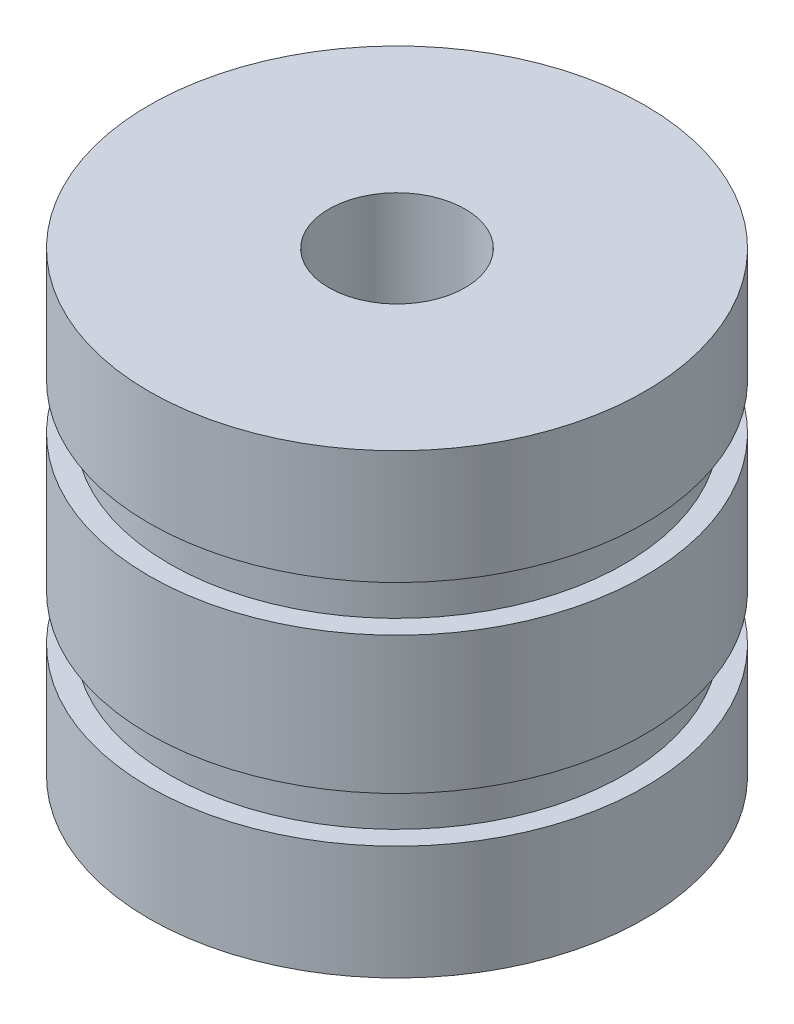
ISO-10303-21;
HEADER;
FILE_DESCRIPTION(('STEP AP214'),'2;1');
FILE_NAME('part.step','',(''),(''),'','','');
FILE_SCHEMA(('AUTOMOTIVE_DESIGN { 1 0 10303 214 1 1 1 1 }'));
ENDSEC;
DATA;
#1=APPLICATION_CONTEXT('core data for automotive mechanical design processes');
#2=APPLICATION_PROTOCOL_DEFINITION('international standard','automotive_design',2000,#1);
#3=PRODUCT_CONTEXT('',#1,'mechanical');
#4=PRODUCT('Part','Part','',(#3));
#5=PRODUCT_RELATED_PRODUCT_CATEGORY('part','',(#4));
#6=PRODUCT_DEFINITION_FORMATION('','',#4);
#7=PRODUCT_DEFINITION_CONTEXT('part definition',#1,'design');
#8=PRODUCT_DEFINITION('design','',#6,#7);
#9=PRODUCT_DEFINITION_SHAPE('','',#8);
#10=(LENGTH_UNIT() NAMED_UNIT(*) SI_UNIT(.MILLI.,.METRE.));
#11=(NAMED_UNIT(*) PLANE_ANGLE_UNIT() SI_UNIT($,.RADIAN.));
#12=(NAMED_UNIT(*) SI_UNIT($,.STERADIAN.) SOLID_ANGLE_UNIT());
#13=UNCERTAINTY_MEASURE_WITH_UNIT(LENGTH_MEASURE(1.E-05),#10,'distance_accuracy_value','');
#14=(GEOMETRIC_REPRESENTATION_CONTEXT(3) GLOBAL_UNCERTAINTY_ASSIGNED_CONTEXT((#13)) GLOBAL_UNIT_ASSIGNED_CONTEXT((#10,
#11,#12)) REPRESENTATION_CONTEXT('',''));
#15=CARTESIAN_POINT('',(0.,0.,0.));
#16=DIRECTION('',(0.,0.,1.));
#17=DIRECTION('',(1.,0.,0.));
#18=AXIS2_PLACEMENT_3D('',#15,#16,#17);
#19=CARTESIAN_POINT('',(0.,0.,0.));
#20=DIRECTION('',(0.,1.,0.));
#21=DIRECTION('',(0.,0.,1.));
#22=AXIS2_PLACEMENT_3D('',#19,#20,#21);
#23=PLANE('',#22);
#24=CARTESIAN_POINT('',(0.,0.,0.));
#25=DIRECTION('',(0.,1.,0.));
#26=DIRECTION('',(0.,0.,1.));
#27=AXIS2_PLACEMENT_3D('',#24,#25,#26);
#28=CIRCLE('',#27,6.);
#29=CARTESIAN_POINT('',(0.,0.,6.));
#30=VERTEX_POINT('',#29);
#31=EDGE_CURVE('E11',#30,#30,#28,.T.);
#32=ORIENTED_EDGE('',*,*,#31,.F.);
#33=EDGE_LOOP('',(#32));
#34=FACE_BOUND('',#33,.T.);
#35=ADVANCED_FACE('F44',(#34),#23,.F.);
#36=CARTESIAN_POINT('',(0.,48.8279050139115,0.));
#37=DIRECTION('',(0.,1.,0.));
#38=DIRECTION('',(0.,0.,1.));
#39=AXIS2_PLACEMENT_3D('',#36,#37,#38);
#40=CYLINDRICAL_SURFACE('',#39,6.);
#41=CARTESIAN_POINT('',(0.,2.76262293916898,0.));
#42=DIRECTION('',(0.,1.,0.));
#43=DIRECTION('',(0.,0.,1.));
#44=AXIS2_PLACEMENT_3D('',#41,#42,#43);
#45=CIRCLE('',#44,6.);
#46=CARTESIAN_POINT('',(0.,2.76262293916898,6.));
#47=VERTEX_POINT('',#46);
#48=EDGE_CURVE('E51',#47,#47,#45,.T.);
#49=ORIENTED_EDGE('',*,*,#48,.F.);
#50=EDGE_LOOP('',(#49));
#51=FACE_BOUND('',#50,.T.);
#52=ORIENTED_EDGE('',*,*,#31,.T.);
#53=EDGE_LOOP('',(#52));
#54=FACE_BOUND('',#53,.T.);
#55=ADVANCED_FACE('F108',(#51,#54),#40,.T.);
#56=CARTESIAN_POINT('',(6.,2.76262293916898,0.));
#57=DIRECTION('',(0.,-1.,0.));
#58=DIRECTION('',(0.,0.,-1.));
#59=AXIS2_PLACEMENT_3D('',#56,#57,#58);
#60=PLANE('',#59);
#61=CARTESIAN_POINT('',(0.,2.76262293916898,0.));
#62=DIRECTION('',(0.,1.,0.));
#63=DIRECTION('',(0.,0.,1.));
#64=AXIS2_PLACEMENT_3D('',#61,#62,#63);
#65=CIRCLE('',#64,5.5);
#66=CARTESIAN_POINT('',(0.,2.76262293916898,5.5));
#67=VERTEX_POINT('',#66);
#68=EDGE_CURVE('E99',#67,#67,#65,.T.);
#69=ORIENTED_EDGE('',*,*,#68,.F.);
#70=EDGE_LOOP('',(#69));
#71=FACE_BOUND('',#70,.T.);
#72=ORIENTED_EDGE('',*,*,#48,.T.);
#73=EDGE_LOOP('',(#72));
#74=FACE_BOUND('',#73,.T.);
#75=ADVANCED_FACE('F106',(#71,#74),#60,.F.);
#76=CARTESIAN_POINT('',(0.,48.8279050139115,0.));
#77=DIRECTION('',(0.,1.,0.));
#78=DIRECTION('',(0.,0.,1.));
#79=AXIS2_PLACEMENT_3D('',#76,#77,#78);
#80=CYLINDRICAL_SURFACE('',#79,5.5);
#81=CARTESIAN_POINT('',(0.,3.86767211483657,0.));
#82=DIRECTION('',(0.,1.,0.));
#83=DIRECTION('',(0.,0.,1.));
#84=AXIS2_PLACEMENT_3D('',#81,#82,#83);
#85=CIRCLE('',#84,5.5);
#86=CARTESIAN_POINT('',(0.,3.86767211483657,5.5));
#87=VERTEX_POINT('',#86);
#88=EDGE_CURVE('E95',#87,#87,#85,.T.);
#89=ORIENTED_EDGE('',*,*,#88,.F.);
#90=EDGE_LOOP('',(#89));
#91=FACE_BOUND('',#90,.T.);
#92=ORIENTED_EDGE('',*,*,#68,.T.);
#93=EDGE_LOOP('',(#92));
#94=FACE_BOUND('',#93,.T.);
#95=ADVANCED_FACE('F126',(#91,#94),#80,.T.);
#96=CARTESIAN_POINT('',(5.5,3.86767211483657,0.));
#97=DIRECTION('',(0.,1.,0.));
#98=DIRECTION('',(0.,0.,1.));
#99=AXIS2_PLACEMENT_3D('',#96,#97,#98);
#100=PLANE('',#99);
#101=CARTESIAN_POINT('',(0.,3.86767211483657,0.));
#102=DIRECTION('',(0.,1.,0.));
#103=DIRECTION('',(0.,0.,1.));
#104=AXIS2_PLACEMENT_3D('',#101,#102,#103);
#105=CIRCLE('',#104,6.);
#106=CARTESIAN_POINT('',(0.,3.86767211483657,6.));
#107=VERTEX_POINT('',#106);
#108=EDGE_CURVE('E91',#107,#107,#105,.T.);
#109=ORIENTED_EDGE('',*,*,#108,.F.);
#110=EDGE_LOOP('',(#109));
#111=FACE_BOUND('',#110,.T.);
#112=ORIENTED_EDGE('',*,*,#88,.T.);
#113=EDGE_LOOP('',(#112));
#114=FACE_BOUND('',#113,.T.);
#115=ADVANCED_FACE('F134',(#111,#114),#100,.F.);
#116=CARTESIAN_POINT('',(0.,48.8279050139115,0.));
#117=DIRECTION('',(0.,1.,0.));
#118=DIRECTION('',(0.,0.,1.));
#119=AXIS2_PLACEMENT_3D('',#116,#117,#118);
#120=CYLINDRICAL_SURFACE('',#119,6.);
#121=CARTESIAN_POINT('',(0.,7.18525940093314,0.));
#122=DIRECTION('',(0.,1.,0.));
#123=DIRECTION('',(0.,0.,1.));
#124=AXIS2_PLACEMENT_3D('',#121,#122,#123);
#125=CIRCLE('',#124,6.);
#126=CARTESIAN_POINT('',(0.,7.18525940093314,6.));
#127=VERTEX_POINT('',#126);
#128=EDGE_CURVE('E87',#127,#127,#125,.T.);
#129=ORIENTED_EDGE('',*,*,#128,.F.);
#130=EDGE_LOOP('',(#129));
#131=FACE_BOUND('',#130,.T.);
#132=ORIENTED_EDGE('',*,*,#108,.T.);
#133=EDGE_LOOP('',(#132));
#134=FACE_BOUND('',#133,.T.);
#135=ADVANCED_FACE('F142',(#131,#134),#120,.T.);
#136=CARTESIAN_POINT('',(6.,7.18525940093314,0.));
#137=DIRECTION('',(0.,-1.,0.));
#138=DIRECTION('',(0.,0.,-1.));
#139=AXIS2_PLACEMENT_3D('',#136,#137,#138);
#140=PLANE('',#139);
#141=CARTESIAN_POINT('',(0.,7.18525940093314,0.));
#142=DIRECTION('',(0.,1.,0.));
#143=DIRECTION('',(0.,0.,1.));
#144=AXIS2_PLACEMENT_3D('',#141,#142,#143);
#145=CIRCLE('',#144,5.5);
#146=CARTESIAN_POINT('',(0.,7.18525940093314,5.5));
#147=VERTEX_POINT('',#146);
#148=EDGE_CURVE('E83',#147,#147,#145,.T.);
#149=ORIENTED_EDGE('',*,*,#148,.F.);
#150=EDGE_LOOP('',(#149));
#151=FACE_BOUND('',#150,.T.);
#152=ORIENTED_EDGE('',*,*,#128,.T.);
#153=EDGE_LOOP('',(#152));
#154=FACE_BOUND('',#153,.T.);
#155=ADVANCED_FACE('F150',(#151,#154),#140,.F.);
#156=CARTESIAN_POINT('',(0.,48.8279050139115,0.));
#157=DIRECTION('',(0.,1.,0.));
#158=DIRECTION('',(0.,0.,1.));
#159=AXIS2_PLACEMENT_3D('',#156,#157,#158);
#160=CYLINDRICAL_SURFACE('',#159,5.5);
#161=CARTESIAN_POINT('',(0.,8.29030857660073,0.));
#162=DIRECTION('',(0.,1.,0.));
#163=DIRECTION('',(0.,0.,1.));
#164=AXIS2_PLACEMENT_3D('',#161,#162,#163);
#165=CIRCLE('',#164,5.5);
#166=CARTESIAN_POINT('',(0.,8.29030857660073,5.5));
#167=VERTEX_POINT('',#166);
#168=EDGE_CURVE('E79',#167,#167,#165,.T.);
#169=ORIENTED_EDGE('',*,*,#168,.F.);
#170=EDGE_LOOP('',(#169));
#171=FACE_BOUND('',#170,.T.);
#172=ORIENTED_EDGE('',*,*,#148,.T.);
#173=EDGE_LOOP('',(#172));
#174=FACE_BOUND('',#173,.T.);
#175=ADVANCED_FACE('F158',(#171,#174),#160,.T.);
#176=CARTESIAN_POINT('',(5.5,8.29030857660073,0.));
#177=DIRECTION('',(0.,1.,0.));
#178=DIRECTION('',(0.,0.,1.));
#179=AXIS2_PLACEMENT_3D('',#176,#177,#178);
#180=PLANE('',#179);
#181=CARTESIAN_POINT('',(0.,8.29030857660073,0.));
#182=DIRECTION('',(0.,1.,0.));
#183=DIRECTION('',(0.,0.,1.));
#184=AXIS2_PLACEMENT_3D('',#181,#182,#183);
#185=CIRCLE('',#184,6.);
#186=CARTESIAN_POINT('',(0.,8.29030857660073,6.));
#187=VERTEX_POINT('',#186);
#188=EDGE_CURVE('E71',#187,#187,#185,.T.);
#189=ORIENTED_EDGE('',*,*,#188,.F.);
#190=EDGE_LOOP('',(#189));
#191=FACE_BOUND('',#190,.T.);
#192=ORIENTED_EDGE('',*,*,#168,.T.);
#193=EDGE_LOOP('',(#192));
#194=FACE_BOUND('',#193,.T.);
#195=ADVANCED_FACE('F166',(#191,#194),#180,.F.);
#196=CARTESIAN_POINT('',(0.,48.8279050139115,0.));
#197=DIRECTION('',(0.,1.,0.));
#198=DIRECTION('',(0.,0.,1.));
#199=AXIS2_PLACEMENT_3D('',#196,#197,#198);
#200=CYLINDRICAL_SURFACE('',#199,6.);
#201=CARTESIAN_POINT('',(0.,11.0529315157697,0.));
#202=DIRECTION('',(0.,1.,0.));
#203=DIRECTION('',(0.,0.,1.));
#204=AXIS2_PLACEMENT_3D('',#201,#202,#203);
#205=CIRCLE('',#204,6.);
#206=CARTESIAN_POINT('',(0.,11.0529315157697,6.));
#207=VERTEX_POINT('',#206);
#208=EDGE_CURVE('E65',#207,#207,#205,.T.);
#209=ORIENTED_EDGE('',*,*,#208,.F.);
#210=EDGE_LOOP('',(#209));
#211=FACE_BOUND('',#210,.T.);
#212=ORIENTED_EDGE('',*,*,#188,.T.);
#213=EDGE_LOOP('',(#212));
#214=FACE_BOUND('',#213,.T.);
#215=ADVANCED_FACE('F174',(#211,#214),#200,.T.);
#216=CARTESIAN_POINT('',(6.,11.0529315157697,0.));
#217=DIRECTION('',(0.,-1.,0.));
#218=DIRECTION('',(0.,0.,-1.));
#219=AXIS2_PLACEMENT_3D('',#216,#217,#218);
#220=PLANE('',#219);
#221=CARTESIAN_POINT('',(0.,11.0529315157697,0.));
#222=DIRECTION('',(0.,1.,0.));
#223=DIRECTION('',(0.,0.,1.));
#224=AXIS2_PLACEMENT_3D('',#221,#222,#223);
#225=CIRCLE('',#224,1.65);
#226=CARTESIAN_POINT('',(0.,11.0529315157697,1.65));
#227=VERTEX_POINT('',#226);
#228=EDGE_CURVE('E66',#227,#227,#225,.T.);
#229=ORIENTED_EDGE('',*,*,#228,.F.);
#230=EDGE_LOOP('',(#229));
#231=FACE_BOUND('',#230,.T.);
#232=ORIENTED_EDGE('',*,*,#208,.T.);
#233=EDGE_LOOP('',(#232));
#234=FACE_BOUND('',#233,.T.);
#235=ADVANCED_FACE('F58',(#231,#234),#220,.F.);
#236=CARTESIAN_POINT('',(0.,3.05293151576971,0.));
#237=DIRECTION('',(0.,1.,0.));
#238=DIRECTION('',(0.,0.,1.));
#239=AXIS2_PLACEMENT_3D('',#236,#237,#238);
#240=CONICAL_SURFACE('',#239,1.65,1.02974425867665);
#241=CARTESIAN_POINT('',(0.,2.06151149437423,0.));
#242=VERTEX_POINT('',#241);
#243=VERTEX_LOOP('',#242);
#244=FACE_BOUND('',#243,.T.);
#245=CARTESIAN_POINT('',(0.,3.05293151576971,0.));
#246=DIRECTION('',(0.,1.,0.));
#247=DIRECTION('',(0.,0.,1.));
#248=AXIS2_PLACEMENT_3D('',#245,#246,#247);
#249=CIRCLE('',#248,1.65);
#250=CARTESIAN_POINT('',(0.,3.05293151576971,1.65));
#251=VERTEX_POINT('',#250);
#252=EDGE_CURVE('E62',#251,#251,#249,.T.);
#253=ORIENTED_EDGE('',*,*,#252,.T.);
#254=EDGE_LOOP('',(#253));
#255=FACE_BOUND('',#254,.T.);
#256=ADVANCED_FACE('F54',(#244,#255),#240,.F.);
#257=CARTESIAN_POINT('',(0.,11.0529315157697,0.));
#258=DIRECTION('',(0.,1.,0.));
#259=DIRECTION('',(0.,0.,1.));
#260=AXIS2_PLACEMENT_3D('',#257,#258,#259);
#261=CYLINDRICAL_SURFACE('',#260,1.65);
#262=ORIENTED_EDGE('',*,*,#252,.F.);
#263=EDGE_LOOP('',(#262));
#264=FACE_BOUND('',#263,.T.);
#265=ORIENTED_EDGE('',*,*,#228,.T.);
#266=EDGE_LOOP('',(#265));
#267=FACE_BOUND('',#266,.T.);
#268=ADVANCED_FACE('F57',(#264,#267),#261,.F.);
#269=CLOSED_SHELL('',(#35,#55,#75,#95,#115,#135,#155,#175,#195,#215,#235,#256,#268));
#270=MANIFOLD_SOLID_BREP('B2',#269);
#271=ADVANCED_BREP_SHAPE_REPRESENTATION('',(#18,#270),#14);
#272=SHAPE_DEFINITION_REPRESENTATION(#9,#271);
ENDSEC;
END-ISO-10303-21;
